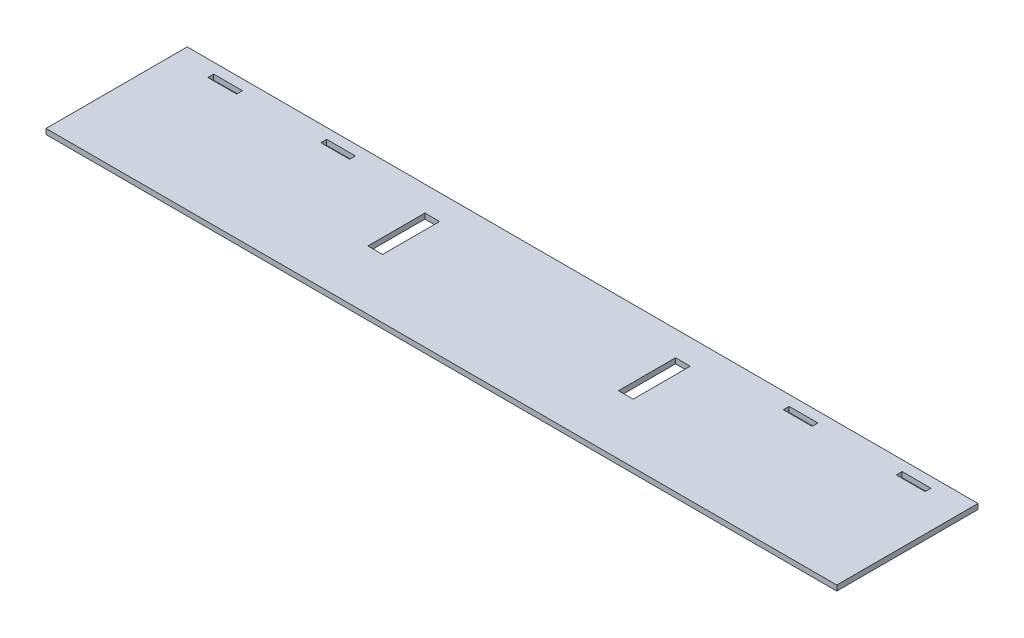
ISO-10303-21;
HEADER;
FILE_DESCRIPTION(('STEP AP214'),'2;1');
FILE_NAME('part.step','',(''),(''),'','','');
FILE_SCHEMA(('AUTOMOTIVE_DESIGN { 1 0 10303 214 1 1 1 1 }'));
ENDSEC;
DATA;
#1=APPLICATION_CONTEXT('core data for automotive mechanical design processes');
#2=APPLICATION_PROTOCOL_DEFINITION('international standard','automotive_design',2000,#1);
#3=PRODUCT_CONTEXT('',#1,'mechanical');
#4=PRODUCT('Part','Part','',(#3));
#5=PRODUCT_RELATED_PRODUCT_CATEGORY('part','',(#4));
#6=PRODUCT_DEFINITION_FORMATION('','',#4);
#7=PRODUCT_DEFINITION_CONTEXT('part definition',#1,'design');
#8=PRODUCT_DEFINITION('design','',#6,#7);
#9=PRODUCT_DEFINITION_SHAPE('','',#8);
#10=(LENGTH_UNIT() NAMED_UNIT(*) SI_UNIT(.MILLI.,.METRE.));
#11=(NAMED_UNIT(*) PLANE_ANGLE_UNIT() SI_UNIT($,.RADIAN.));
#12=(NAMED_UNIT(*) SI_UNIT($,.STERADIAN.) SOLID_ANGLE_UNIT());
#13=UNCERTAINTY_MEASURE_WITH_UNIT(LENGTH_MEASURE(1.E-05),#10,'distance_accuracy_value','');
#14=(GEOMETRIC_REPRESENTATION_CONTEXT(3) GLOBAL_UNCERTAINTY_ASSIGNED_CONTEXT((#13)) GLOBAL_UNIT_ASSIGNED_CONTEXT((#10,
#11,#12)) REPRESENTATION_CONTEXT('',''));
#15=CARTESIAN_POINT('',(0.,0.,0.));
#16=DIRECTION('',(0.,0.,1.));
#17=DIRECTION('',(1.,0.,0.));
#18=AXIS2_PLACEMENT_3D('',#15,#16,#17);
#19=CARTESIAN_POINT('',(-355.6,4.7625,0.));
#20=DIRECTION('',(1.,0.,0.));
#21=DIRECTION('',(0.,0.,-1.));
#22=AXIS2_PLACEMENT_3D('',#19,#20,#21);
#23=PLANE('',#22);
#24=DIRECTION('',(0.,0.,1.));
#25=VECTOR('',#24,1.);
#26=CARTESIAN_POINT('',(-355.6,0.,0.));
#27=LINE('',#26,#25);
#28=CARTESIAN_POINT('',(-355.6,0.,-127.));
#29=VERTEX_POINT('',#28);
#30=CARTESIAN_POINT('',(-355.6,0.,0.));
#31=VERTEX_POINT('',#30);
#32=EDGE_CURVE('E209',#29,#31,#27,.T.);
#33=ORIENTED_EDGE('',*,*,#32,.T.);
#34=DIRECTION('',(0.,-1.,0.));
#35=VECTOR('',#34,1.);
#36=CARTESIAN_POINT('',(-355.6,4.7625,0.));
#37=LINE('',#36,#35);
#38=CARTESIAN_POINT('',(-355.6,4.7625,0.));
#39=VERTEX_POINT('',#38);
#40=EDGE_CURVE('E195',#39,#31,#37,.T.);
#41=ORIENTED_EDGE('',*,*,#40,.F.);
#42=DIRECTION('',(0.,0.,1.));
#43=VECTOR('',#42,1.);
#44=CARTESIAN_POINT('',(-355.6,4.7625,0.));
#45=LINE('',#44,#43);
#46=CARTESIAN_POINT('',(-355.6,4.7625,-127.));
#47=VERTEX_POINT('',#46);
#48=EDGE_CURVE('E228',#47,#39,#45,.T.);
#49=ORIENTED_EDGE('',*,*,#48,.F.);
#50=DIRECTION('',(0.,-1.,0.));
#51=VECTOR('',#50,1.);
#52=CARTESIAN_POINT('',(-355.6,4.7625,-127.));
#53=LINE('',#52,#51);
#54=EDGE_CURVE('E206',#47,#29,#53,.T.);
#55=ORIENTED_EDGE('',*,*,#54,.T.);
#56=EDGE_LOOP('',(#33,#41,#49,#55));
#57=FACE_BOUND('',#56,.T.);
#58=ADVANCED_FACE('F34',(#57),#23,.F.);
#59=CARTESIAN_POINT('',(-355.6,4.7625,0.));
#60=DIRECTION('',(0.,0.,-1.));
#61=DIRECTION('',(-1.,0.,0.));
#62=AXIS2_PLACEMENT_3D('',#59,#60,#61);
#63=PLANE('',#62);
#64=DIRECTION('',(1.,0.,0.));
#65=VECTOR('',#64,1.);
#66=CARTESIAN_POINT('',(-355.6,0.,0.));
#67=LINE('',#66,#65);
#68=CARTESIAN_POINT('',(355.6,0.,0.));
#69=VERTEX_POINT('',#68);
#70=EDGE_CURVE('E199',#31,#69,#67,.T.);
#71=ORIENTED_EDGE('',*,*,#70,.T.);
#72=DIRECTION('',(0.,-1.,0.));
#73=VECTOR('',#72,1.);
#74=CARTESIAN_POINT('',(355.6,4.7625,0.));
#75=LINE('',#74,#73);
#76=CARTESIAN_POINT('',(355.6,4.7625,0.));
#77=VERTEX_POINT('',#76);
#78=EDGE_CURVE('E200',#77,#69,#75,.T.);
#79=ORIENTED_EDGE('',*,*,#78,.F.);
#80=DIRECTION('',(1.,0.,0.));
#81=VECTOR('',#80,1.);
#82=CARTESIAN_POINT('',(-355.6,4.7625,0.));
#83=LINE('',#82,#81);
#84=EDGE_CURVE('E225',#39,#77,#83,.T.);
#85=ORIENTED_EDGE('',*,*,#84,.F.);
#86=ORIENTED_EDGE('',*,*,#40,.T.);
#87=EDGE_LOOP('',(#71,#79,#85,#86));
#88=FACE_BOUND('',#87,.T.);
#89=ADVANCED_FACE('F470',(#88),#63,.F.);
#90=CARTESIAN_POINT('',(355.6,4.7625,0.));
#91=DIRECTION('',(-1.,0.,0.));
#92=DIRECTION('',(0.,0.,1.));
#93=AXIS2_PLACEMENT_3D('',#90,#91,#92);
#94=PLANE('',#93);
#95=DIRECTION('',(0.,0.,-1.));
#96=VECTOR('',#95,1.);
#97=CARTESIAN_POINT('',(355.6,0.,0.));
#98=LINE('',#97,#96);
#99=CARTESIAN_POINT('',(355.6,0.,-127.));
#100=VERTEX_POINT('',#99);
#101=EDGE_CURVE('E198',#69,#100,#98,.T.);
#102=ORIENTED_EDGE('',*,*,#101,.T.);
#103=DIRECTION('',(0.,-1.,0.));
#104=VECTOR('',#103,1.);
#105=CARTESIAN_POINT('',(355.6,4.7625,-127.));
#106=LINE('',#105,#104);
#107=CARTESIAN_POINT('',(355.6,4.7625,-127.));
#108=VERTEX_POINT('',#107);
#109=EDGE_CURVE('E97',#108,#100,#106,.T.);
#110=ORIENTED_EDGE('',*,*,#109,.F.);
#111=DIRECTION('',(0.,0.,-1.));
#112=VECTOR('',#111,1.);
#113=CARTESIAN_POINT('',(355.6,4.7625,0.));
#114=LINE('',#113,#112);
#115=EDGE_CURVE('E222',#77,#108,#114,.T.);
#116=ORIENTED_EDGE('',*,*,#115,.F.);
#117=ORIENTED_EDGE('',*,*,#78,.T.);
#118=EDGE_LOOP('',(#102,#110,#116,#117));
#119=FACE_BOUND('',#118,.T.);
#120=ADVANCED_FACE('F476',(#119),#94,.F.);
#121=CARTESIAN_POINT('',(-355.6,4.7625,-127.));
#122=DIRECTION('',(0.,0.,1.));
#123=DIRECTION('',(1.,0.,0.));
#124=AXIS2_PLACEMENT_3D('',#121,#122,#123);
#125=PLANE('',#124);
#126=DIRECTION('',(-1.,0.,0.));
#127=VECTOR('',#126,1.);
#128=CARTESIAN_POINT('',(-355.6,0.,-127.));
#129=LINE('',#128,#127);
#130=EDGE_CURVE('E203',#100,#29,#129,.T.);
#131=ORIENTED_EDGE('',*,*,#130,.T.);
#132=ORIENTED_EDGE('',*,*,#54,.F.);
#133=DIRECTION('',(-1.,0.,0.));
#134=VECTOR('',#133,1.);
#135=CARTESIAN_POINT('',(-355.6,4.7625,-127.));
#136=LINE('',#135,#134);
#137=EDGE_CURVE('E218',#108,#47,#136,.T.);
#138=ORIENTED_EDGE('',*,*,#137,.F.);
#139=ORIENTED_EDGE('',*,*,#109,.T.);
#140=EDGE_LOOP('',(#131,#132,#138,#139));
#141=FACE_BOUND('',#140,.T.);
#142=ADVANCED_FACE('F531',(#141),#125,.F.);
#143=CARTESIAN_POINT('',(0.,4.7625,0.));
#144=DIRECTION('',(0.,-1.,0.));
#145=DIRECTION('',(0.,0.,-1.));
#146=AXIS2_PLACEMENT_3D('',#143,#144,#145);
#147=PLANE('',#146);
#148=DIRECTION('',(-1.,0.,0.));
#149=VECTOR('',#148,1.);
#150=CARTESIAN_POINT('',(296.6085,4.7625,-112.4585));
#151=LINE('',#150,#149);
#152=CARTESIAN_POINT('',(322.5165,4.7625,-112.4585));
#153=VERTEX_POINT('',#152);
#154=CARTESIAN_POINT('',(296.6085,4.7625,-112.4585));
#155=VERTEX_POINT('',#154);
#156=EDGE_CURVE('E75',#153,#155,#151,.T.);
#157=ORIENTED_EDGE('',*,*,#156,.T.);
#158=DIRECTION('',(0.,0.,-1.));
#159=VECTOR('',#158,1.);
#160=CARTESIAN_POINT('',(296.6085,4.7625,-112.4585));
#161=LINE('',#160,#159);
#162=CARTESIAN_POINT('',(296.6085,4.7625,-117.729));
#163=VERTEX_POINT('',#162);
#164=EDGE_CURVE('E38',#155,#163,#161,.T.);
#165=ORIENTED_EDGE('',*,*,#164,.T.);
#166=DIRECTION('',(1.,0.,0.));
#167=VECTOR('',#166,1.);
#168=CARTESIAN_POINT('',(296.6085,4.7625,-117.729));
#169=LINE('',#168,#167);
#170=CARTESIAN_POINT('',(322.5165,4.7625,-117.729));
#171=VERTEX_POINT('',#170);
#172=EDGE_CURVE('E100',#163,#171,#169,.T.);
#173=ORIENTED_EDGE('',*,*,#172,.T.);
#174=DIRECTION('',(0.,0.,1.));
#175=VECTOR('',#174,1.);
#176=CARTESIAN_POINT('',(322.5165,4.7625,-112.4585));
#177=LINE('',#176,#175);
#178=EDGE_CURVE('E98',#171,#153,#177,.T.);
#179=ORIENTED_EDGE('',*,*,#178,.T.);
#180=EDGE_LOOP('',(#157,#165,#173,#179));
#181=FACE_BOUND('',#180,.T.);
#182=DIRECTION('',(-1.,0.,0.));
#183=VECTOR('',#182,1.);
#184=CARTESIAN_POINT('',(195.0085,4.7625,-112.4585));
#185=LINE('',#184,#183);
#186=CARTESIAN_POINT('',(220.9165,4.7625,-112.4585));
#187=VERTEX_POINT('',#186);
#188=CARTESIAN_POINT('',(195.0085,4.7625,-112.4585));
#189=VERTEX_POINT('',#188);
#190=EDGE_CURVE('E99',#187,#189,#185,.T.);
#191=ORIENTED_EDGE('',*,*,#190,.T.);
#192=DIRECTION('',(0.,0.,-1.));
#193=VECTOR('',#192,1.);
#194=CARTESIAN_POINT('',(195.0085,4.7625,-112.4585));
#195=LINE('',#194,#193);
#196=CARTESIAN_POINT('',(195.0085,4.7625,-117.729));
#197=VERTEX_POINT('',#196);
#198=EDGE_CURVE('E320',#189,#197,#195,.T.);
#199=ORIENTED_EDGE('',*,*,#198,.T.);
#200=DIRECTION('',(1.,0.,0.));
#201=VECTOR('',#200,1.);
#202=CARTESIAN_POINT('',(195.0085,4.7625,-117.729));
#203=LINE('',#202,#201);
#204=CARTESIAN_POINT('',(220.9165,4.7625,-117.729));
#205=VERTEX_POINT('',#204);
#206=EDGE_CURVE('E323',#197,#205,#203,.T.);
#207=ORIENTED_EDGE('',*,*,#206,.T.);
#208=DIRECTION('',(0.,0.,1.));
#209=VECTOR('',#208,1.);
#210=CARTESIAN_POINT('',(220.9165,4.7625,-112.4585));
#211=LINE('',#210,#209);
#212=EDGE_CURVE('E128',#205,#187,#211,.T.);
#213=ORIENTED_EDGE('',*,*,#212,.T.);
#214=EDGE_LOOP('',(#191,#199,#207,#213));
#215=FACE_BOUND('',#214,.T.);
#216=DIRECTION('',(-1.,0.,0.));
#217=VECTOR('',#216,1.);
#218=CARTESIAN_POINT('',(-220.9165,4.7625,-112.4585));
#219=LINE('',#218,#217);
#220=CARTESIAN_POINT('',(-195.0085,4.7625,-112.4585));
#221=VERTEX_POINT('',#220);
#222=CARTESIAN_POINT('',(-220.9165,4.7625,-112.4585));
#223=VERTEX_POINT('',#222);
#224=EDGE_CURVE('E119',#221,#223,#219,.T.);
#225=ORIENTED_EDGE('',*,*,#224,.T.);
#226=DIRECTION('',(0.,0.,-1.));
#227=VECTOR('',#226,1.);
#228=CARTESIAN_POINT('',(-220.9165,4.7625,-117.729));
#229=LINE('',#228,#227);
#230=CARTESIAN_POINT('',(-220.9165,4.7625,-117.729));
#231=VERTEX_POINT('',#230);
#232=EDGE_CURVE('E115',#223,#231,#229,.T.);
#233=ORIENTED_EDGE('',*,*,#232,.T.);
#234=DIRECTION('',(1.,0.,0.));
#235=VECTOR('',#234,1.);
#236=CARTESIAN_POINT('',(-220.9165,4.7625,-117.729));
#237=LINE('',#236,#235);
#238=CARTESIAN_POINT('',(-195.0085,4.7625,-117.729));
#239=VERTEX_POINT('',#238);
#240=EDGE_CURVE('E118',#231,#239,#237,.T.);
#241=ORIENTED_EDGE('',*,*,#240,.T.);
#242=DIRECTION('',(0.,0.,1.));
#243=VECTOR('',#242,1.);
#244=CARTESIAN_POINT('',(-195.0085,4.7625,-117.729));
#245=LINE('',#244,#243);
#246=EDGE_CURVE('E122',#239,#221,#245,.T.);
#247=ORIENTED_EDGE('',*,*,#246,.T.);
#248=EDGE_LOOP('',(#225,#233,#241,#247));
#249=FACE_BOUND('',#248,.T.);
#250=DIRECTION('',(-1.,0.,0.));
#251=VECTOR('',#250,1.);
#252=CARTESIAN_POINT('',(-322.5165,4.7625,-112.4585));
#253=LINE('',#252,#251);
#254=CARTESIAN_POINT('',(-296.6085,4.7625,-112.4585));
#255=VERTEX_POINT('',#254);
#256=CARTESIAN_POINT('',(-322.5165,4.7625,-112.4585));
#257=VERTEX_POINT('',#256);
#258=EDGE_CURVE('E125',#255,#257,#253,.T.);
#259=ORIENTED_EDGE('',*,*,#258,.T.);
#260=DIRECTION('',(0.,0.,-1.));
#261=VECTOR('',#260,1.);
#262=CARTESIAN_POINT('',(-322.5165,4.7625,-117.729));
#263=LINE('',#262,#261);
#264=CARTESIAN_POINT('',(-322.5165,4.7625,-117.729));
#265=VERTEX_POINT('',#264);
#266=EDGE_CURVE('E288',#257,#265,#263,.T.);
#267=ORIENTED_EDGE('',*,*,#266,.T.);
#268=DIRECTION('',(1.,0.,0.));
#269=VECTOR('',#268,1.);
#270=CARTESIAN_POINT('',(-322.5165,4.7625,-117.729));
#271=LINE('',#270,#269);
#272=CARTESIAN_POINT('',(-296.6085,4.7625,-117.729));
#273=VERTEX_POINT('',#272);
#274=EDGE_CURVE('E291',#265,#273,#271,.T.);
#275=ORIENTED_EDGE('',*,*,#274,.T.);
#276=DIRECTION('',(0.,0.,1.));
#277=VECTOR('',#276,1.);
#278=CARTESIAN_POINT('',(-296.6085,4.7625,-117.729));
#279=LINE('',#278,#277);
#280=EDGE_CURVE('E168',#273,#255,#279,.T.);
#281=ORIENTED_EDGE('',*,*,#280,.T.);
#282=EDGE_LOOP('',(#259,#267,#275,#281));
#283=FACE_BOUND('',#282,.T.);
#284=DIRECTION('',(-1.,0.,0.));
#285=VECTOR('',#284,1.);
#286=CARTESIAN_POINT('',(-119.3165,4.7625,-53.1759020301662));
#287=LINE('',#286,#285);
#288=CARTESIAN_POINT('',(-106.1085,4.7625,-53.1759020301662));
#289=VERTEX_POINT('',#288);
#290=CARTESIAN_POINT('',(-119.3165,4.7625,-53.1759020301662));
#291=VERTEX_POINT('',#290);
#292=EDGE_CURVE('E159',#289,#291,#287,.T.);
#293=ORIENTED_EDGE('',*,*,#292,.T.);
#294=DIRECTION('',(0.,0.,-1.));
#295=VECTOR('',#294,1.);
#296=CARTESIAN_POINT('',(-119.3165,4.7625,-104.483902030166));
#297=LINE('',#296,#295);
#298=CARTESIAN_POINT('',(-119.3165,4.7625,-104.483902030166));
#299=VERTEX_POINT('',#298);
#300=EDGE_CURVE('E155',#291,#299,#297,.T.);
#301=ORIENTED_EDGE('',*,*,#300,.T.);
#302=DIRECTION('',(1.,0.,0.));
#303=VECTOR('',#302,1.);
#304=CARTESIAN_POINT('',(-119.3165,4.7625,-104.483902030166));
#305=LINE('',#304,#303);
#306=CARTESIAN_POINT('',(-106.1085,4.7625,-104.483902030166));
#307=VERTEX_POINT('',#306);
#308=EDGE_CURVE('E158',#299,#307,#305,.T.);
#309=ORIENTED_EDGE('',*,*,#308,.T.);
#310=DIRECTION('',(0.,0.,1.));
#311=VECTOR('',#310,1.);
#312=CARTESIAN_POINT('',(-106.1085,4.7625,-104.483902030166));
#313=LINE('',#312,#311);
#314=EDGE_CURVE('E162',#307,#289,#313,.T.);
#315=ORIENTED_EDGE('',*,*,#314,.T.);
#316=EDGE_LOOP('',(#293,#301,#309,#315));
#317=FACE_BOUND('',#316,.T.);
#318=DIRECTION('',(0.,0.,-1.));
#319=VECTOR('',#318,1.);
#320=CARTESIAN_POINT('',(106.1085,4.7625,-104.483902030166));
#321=LINE('',#320,#319);
#322=CARTESIAN_POINT('',(106.1085,4.7625,-53.1759020301661));
#323=VERTEX_POINT('',#322);
#324=CARTESIAN_POINT('',(106.1085,4.7625,-104.483902030166));
#325=VERTEX_POINT('',#324);
#326=EDGE_CURVE('E165',#323,#325,#321,.T.);
#327=ORIENTED_EDGE('',*,*,#326,.T.);
#328=DIRECTION('',(1.,0.,0.));
#329=VECTOR('',#328,1.);
#330=CARTESIAN_POINT('',(106.1085,4.7625,-104.483902030166));
#331=LINE('',#330,#329);
#332=CARTESIAN_POINT('',(119.3165,4.7625,-104.483902030166));
#333=VERTEX_POINT('',#332);
#334=EDGE_CURVE('E256',#325,#333,#331,.T.);
#335=ORIENTED_EDGE('',*,*,#334,.T.);
#336=DIRECTION('',(0.,0.,1.));
#337=VECTOR('',#336,1.);
#338=CARTESIAN_POINT('',(119.3165,4.7625,-104.483902030166));
#339=LINE('',#338,#337);
#340=CARTESIAN_POINT('',(119.3165,4.7625,-53.1759020301661));
#341=VERTEX_POINT('',#340);
#342=EDGE_CURVE('E259',#333,#341,#339,.T.);
#343=ORIENTED_EDGE('',*,*,#342,.T.);
#344=DIRECTION('',(-1.,0.,0.));
#345=VECTOR('',#344,1.);
#346=CARTESIAN_POINT('',(106.1085,4.7625,-53.1759020301661));
#347=LINE('',#346,#345);
#348=EDGE_CURVE('E231',#341,#323,#347,.T.);
#349=ORIENTED_EDGE('',*,*,#348,.T.);
#350=EDGE_LOOP('',(#327,#335,#343,#349));
#351=FACE_BOUND('',#350,.T.);
#352=ORIENTED_EDGE('',*,*,#48,.T.);
#353=ORIENTED_EDGE('',*,*,#84,.T.);
#354=ORIENTED_EDGE('',*,*,#115,.T.);
#355=ORIENTED_EDGE('',*,*,#137,.T.);
#356=EDGE_LOOP('',(#352,#353,#354,#355));
#357=FACE_BOUND('',#356,.T.);
#358=ADVANCED_FACE('F36',(#181,#215,#249,#283,#317,#351,#357),#147,.F.);
#359=CARTESIAN_POINT('',(0.,0.,0.));
#360=DIRECTION('',(0.,-1.,0.));
#361=DIRECTION('',(0.,0.,-1.));
#362=AXIS2_PLACEMENT_3D('',#359,#360,#361);
#363=PLANE('',#362);
#364=DIRECTION('',(0.,0.,-1.));
#365=VECTOR('',#364,1.);
#366=CARTESIAN_POINT('',(296.6085,0.,-112.4585));
#367=LINE('',#366,#365);
#368=CARTESIAN_POINT('',(296.6085,0.,-112.4585));
#369=VERTEX_POINT('',#368);
#370=CARTESIAN_POINT('',(296.6085,0.,-117.729));
#371=VERTEX_POINT('',#370);
#372=EDGE_CURVE('E87',#369,#371,#367,.T.);
#373=ORIENTED_EDGE('',*,*,#372,.F.);
#374=DIRECTION('',(-1.,0.,0.));
#375=VECTOR('',#374,1.);
#376=CARTESIAN_POINT('',(296.6085,0.,-112.4585));
#377=LINE('',#376,#375);
#378=CARTESIAN_POINT('',(322.5165,0.,-112.4585));
#379=VERTEX_POINT('',#378);
#380=EDGE_CURVE('E72',#379,#369,#377,.T.);
#381=ORIENTED_EDGE('',*,*,#380,.F.);
#382=DIRECTION('',(0.,0.,1.));
#383=VECTOR('',#382,1.);
#384=CARTESIAN_POINT('',(322.5165,0.,-112.4585));
#385=LINE('',#384,#383);
#386=CARTESIAN_POINT('',(322.5165,0.,-117.729));
#387=VERTEX_POINT('',#386);
#388=EDGE_CURVE('E77',#387,#379,#385,.T.);
#389=ORIENTED_EDGE('',*,*,#388,.F.);
#390=DIRECTION('',(1.,0.,0.));
#391=VECTOR('',#390,1.);
#392=CARTESIAN_POINT('',(296.6085,0.,-117.729));
#393=LINE('',#392,#391);
#394=EDGE_CURVE('E44',#371,#387,#393,.T.);
#395=ORIENTED_EDGE('',*,*,#394,.F.);
#396=EDGE_LOOP('',(#373,#381,#389,#395));
#397=FACE_BOUND('',#396,.T.);
#398=DIRECTION('',(0.,0.,-1.));
#399=VECTOR('',#398,1.);
#400=CARTESIAN_POINT('',(195.0085,0.,-112.4585));
#401=LINE('',#400,#399);
#402=CARTESIAN_POINT('',(195.0085,0.,-112.4585));
#403=VERTEX_POINT('',#402);
#404=CARTESIAN_POINT('',(195.0085,0.,-117.729));
#405=VERTEX_POINT('',#404);
#406=EDGE_CURVE('E154',#403,#405,#401,.T.);
#407=ORIENTED_EDGE('',*,*,#406,.F.);
#408=DIRECTION('',(-1.,0.,0.));
#409=VECTOR('',#408,1.);
#410=CARTESIAN_POINT('',(195.0085,0.,-112.4585));
#411=LINE('',#410,#409);
#412=CARTESIAN_POINT('',(220.9165,0.,-112.4585));
#413=VERTEX_POINT('',#412);
#414=EDGE_CURVE('E306',#413,#403,#411,.T.);
#415=ORIENTED_EDGE('',*,*,#414,.F.);
#416=DIRECTION('',(0.,0.,1.));
#417=VECTOR('',#416,1.);
#418=CARTESIAN_POINT('',(220.9165,0.,-112.4585));
#419=LINE('',#418,#417);
#420=CARTESIAN_POINT('',(220.9165,0.,-117.729));
#421=VERTEX_POINT('',#420);
#422=EDGE_CURVE('E302',#421,#413,#419,.T.);
#423=ORIENTED_EDGE('',*,*,#422,.F.);
#424=DIRECTION('',(1.,0.,0.));
#425=VECTOR('',#424,1.);
#426=CARTESIAN_POINT('',(195.0085,0.,-117.729));
#427=LINE('',#426,#425);
#428=EDGE_CURVE('E298',#405,#421,#427,.T.);
#429=ORIENTED_EDGE('',*,*,#428,.F.);
#430=EDGE_LOOP('',(#407,#415,#423,#429));
#431=FACE_BOUND('',#430,.T.);
#432=DIRECTION('',(0.,0.,-1.));
#433=VECTOR('',#432,1.);
#434=CARTESIAN_POINT('',(-220.9165,0.,-117.729));
#435=LINE('',#434,#433);
#436=CARTESIAN_POINT('',(-220.9165,0.,-112.4585));
#437=VERTEX_POINT('',#436);
#438=CARTESIAN_POINT('',(-220.9165,0.,-117.729));
#439=VERTEX_POINT('',#438);
#440=EDGE_CURVE('E129',#437,#439,#435,.T.);
#441=ORIENTED_EDGE('',*,*,#440,.F.);
#442=DIRECTION('',(-1.,0.,0.));
#443=VECTOR('',#442,1.);
#444=CARTESIAN_POINT('',(-220.9165,0.,-112.4585));
#445=LINE('',#444,#443);
#446=CARTESIAN_POINT('',(-195.0085,0.,-112.4585));
#447=VERTEX_POINT('',#446);
#448=EDGE_CURVE('E143',#447,#437,#445,.T.);
#449=ORIENTED_EDGE('',*,*,#448,.F.);
#450=DIRECTION('',(0.,0.,1.));
#451=VECTOR('',#450,1.);
#452=CARTESIAN_POINT('',(-195.0085,0.,-117.729));
#453=LINE('',#452,#451);
#454=CARTESIAN_POINT('',(-195.0085,0.,-117.729));
#455=VERTEX_POINT('',#454);
#456=EDGE_CURVE('E139',#455,#447,#453,.T.);
#457=ORIENTED_EDGE('',*,*,#456,.F.);
#458=DIRECTION('',(1.,0.,0.));
#459=VECTOR('',#458,1.);
#460=CARTESIAN_POINT('',(-220.9165,0.,-117.729));
#461=LINE('',#460,#459);
#462=EDGE_CURVE('E134',#439,#455,#461,.T.);
#463=ORIENTED_EDGE('',*,*,#462,.F.);
#464=EDGE_LOOP('',(#441,#449,#457,#463));
#465=FACE_BOUND('',#464,.T.);
#466=DIRECTION('',(0.,0.,-1.));
#467=VECTOR('',#466,1.);
#468=CARTESIAN_POINT('',(-322.5165,0.,-117.729));
#469=LINE('',#468,#467);
#470=CARTESIAN_POINT('',(-322.5165,0.,-112.4585));
#471=VERTEX_POINT('',#470);
#472=CARTESIAN_POINT('',(-322.5165,0.,-117.729));
#473=VERTEX_POINT('',#472);
#474=EDGE_CURVE('E194',#471,#473,#469,.T.);
#475=ORIENTED_EDGE('',*,*,#474,.F.);
#476=DIRECTION('',(-1.,0.,0.));
#477=VECTOR('',#476,1.);
#478=CARTESIAN_POINT('',(-322.5165,0.,-112.4585));
#479=LINE('',#478,#477);
#480=CARTESIAN_POINT('',(-296.6085,0.,-112.4585));
#481=VERTEX_POINT('',#480);
#482=EDGE_CURVE('E274',#481,#471,#479,.T.);
#483=ORIENTED_EDGE('',*,*,#482,.F.);
#484=DIRECTION('',(0.,0.,1.));
#485=VECTOR('',#484,1.);
#486=CARTESIAN_POINT('',(-296.6085,0.,-117.729));
#487=LINE('',#486,#485);
#488=CARTESIAN_POINT('',(-296.6085,0.,-117.729));
#489=VERTEX_POINT('',#488);
#490=EDGE_CURVE('E270',#489,#481,#487,.T.);
#491=ORIENTED_EDGE('',*,*,#490,.F.);
#492=DIRECTION('',(1.,0.,0.));
#493=VECTOR('',#492,1.);
#494=CARTESIAN_POINT('',(-322.5165,0.,-117.729));
#495=LINE('',#494,#493);
#496=EDGE_CURVE('E266',#473,#489,#495,.T.);
#497=ORIENTED_EDGE('',*,*,#496,.F.);
#498=EDGE_LOOP('',(#475,#483,#491,#497));
#499=FACE_BOUND('',#498,.T.);
#500=DIRECTION('',(0.,0.,-1.));
#501=VECTOR('',#500,1.);
#502=CARTESIAN_POINT('',(-119.3165,0.,-104.483902030166));
#503=LINE('',#502,#501);
#504=CARTESIAN_POINT('',(-119.3165,0.,-53.1759020301662));
#505=VERTEX_POINT('',#504);
#506=CARTESIAN_POINT('',(-119.3165,0.,-104.483902030166));
#507=VERTEX_POINT('',#506);
#508=EDGE_CURVE('E169',#505,#507,#503,.T.);
#509=ORIENTED_EDGE('',*,*,#508,.F.);
#510=DIRECTION('',(-1.,0.,0.));
#511=VECTOR('',#510,1.);
#512=CARTESIAN_POINT('',(-119.3165,0.,-53.1759020301662));
#513=LINE('',#512,#511);
#514=CARTESIAN_POINT('',(-106.1085,0.,-53.1759020301662));
#515=VERTEX_POINT('',#514);
#516=EDGE_CURVE('E183',#515,#505,#513,.T.);
#517=ORIENTED_EDGE('',*,*,#516,.F.);
#518=DIRECTION('',(0.,0.,1.));
#519=VECTOR('',#518,1.);
#520=CARTESIAN_POINT('',(-106.1085,0.,-104.483902030166));
#521=LINE('',#520,#519);
#522=CARTESIAN_POINT('',(-106.1085,0.,-104.483902030166));
#523=VERTEX_POINT('',#522);
#524=EDGE_CURVE('E179',#523,#515,#521,.T.);
#525=ORIENTED_EDGE('',*,*,#524,.F.);
#526=DIRECTION('',(1.,0.,0.));
#527=VECTOR('',#526,1.);
#528=CARTESIAN_POINT('',(-119.3165,0.,-104.483902030166));
#529=LINE('',#528,#527);
#530=EDGE_CURVE('E174',#507,#523,#529,.T.);
#531=ORIENTED_EDGE('',*,*,#530,.F.);
#532=EDGE_LOOP('',(#509,#517,#525,#531));
#533=FACE_BOUND('',#532,.T.);
#534=DIRECTION('',(1.,0.,0.));
#535=VECTOR('',#534,1.);
#536=CARTESIAN_POINT('',(106.1085,0.,-104.483902030166));
#537=LINE('',#536,#535);
#538=CARTESIAN_POINT('',(106.1085,0.,-104.483902030166));
#539=VERTEX_POINT('',#538);
#540=CARTESIAN_POINT('',(119.3165,0.,-104.483902030166));
#541=VERTEX_POINT('',#540);
#542=EDGE_CURVE('E221',#539,#541,#537,.T.);
#543=ORIENTED_EDGE('',*,*,#542,.F.);
#544=DIRECTION('',(0.,0.,-1.));
#545=VECTOR('',#544,1.);
#546=CARTESIAN_POINT('',(106.1085,0.,-104.483902030166));
#547=LINE('',#546,#545);
#548=CARTESIAN_POINT('',(106.1085,0.,-53.1759020301661));
#549=VERTEX_POINT('',#548);
#550=EDGE_CURVE('E242',#549,#539,#547,.T.);
#551=ORIENTED_EDGE('',*,*,#550,.F.);
#552=DIRECTION('',(-1.,0.,0.));
#553=VECTOR('',#552,1.);
#554=CARTESIAN_POINT('',(106.1085,0.,-53.1759020301661));
#555=LINE('',#554,#553);
#556=CARTESIAN_POINT('',(119.3165,0.,-53.1759020301661));
#557=VERTEX_POINT('',#556);
#558=EDGE_CURVE('E238',#557,#549,#555,.T.);
#559=ORIENTED_EDGE('',*,*,#558,.F.);
#560=DIRECTION('',(0.,0.,1.));
#561=VECTOR('',#560,1.);
#562=CARTESIAN_POINT('',(119.3165,0.,-104.483902030166));
#563=LINE('',#562,#561);
#564=EDGE_CURVE('E234',#541,#557,#563,.T.);
#565=ORIENTED_EDGE('',*,*,#564,.F.);
#566=EDGE_LOOP('',(#543,#551,#559,#565));
#567=FACE_BOUND('',#566,.T.);
#568=ORIENTED_EDGE('',*,*,#32,.F.);
#569=ORIENTED_EDGE('',*,*,#130,.F.);
#570=ORIENTED_EDGE('',*,*,#101,.F.);
#571=ORIENTED_EDGE('',*,*,#70,.F.);
#572=EDGE_LOOP('',(#568,#569,#570,#571));
#573=FACE_BOUND('',#572,.T.);
#574=ADVANCED_FACE('F84',(#397,#431,#465,#499,#533,#567,#573),#363,.T.);
#575=CARTESIAN_POINT('',(106.1085,4.7625,-104.483902030166));
#576=DIRECTION('',(0.,0.,-1.));
#577=DIRECTION('',(-1.,0.,0.));
#578=AXIS2_PLACEMENT_3D('',#575,#576,#577);
#579=PLANE('',#578);
#580=ORIENTED_EDGE('',*,*,#542,.T.);
#581=DIRECTION('',(0.,-1.,0.));
#582=VECTOR('',#581,1.);
#583=CARTESIAN_POINT('',(119.3165,4.7625,-104.483902030166));
#584=LINE('',#583,#582);
#585=EDGE_CURVE('E173',#333,#541,#584,.T.);
#586=ORIENTED_EDGE('',*,*,#585,.F.);
#587=ORIENTED_EDGE('',*,*,#334,.F.);
#588=DIRECTION('',(0.,-1.,0.));
#589=VECTOR('',#588,1.);
#590=CARTESIAN_POINT('',(106.1085,4.7625,-104.483902030166));
#591=LINE('',#590,#589);
#592=EDGE_CURVE('E243',#325,#539,#591,.T.);
#593=ORIENTED_EDGE('',*,*,#592,.T.);
#594=EDGE_LOOP('',(#580,#586,#587,#593));
#595=FACE_BOUND('',#594,.T.);
#596=ADVANCED_FACE('F523',(#595),#579,.F.);
#597=CARTESIAN_POINT('',(106.1085,4.7625,-104.483902030166));
#598=DIRECTION('',(-1.,0.,0.));
#599=DIRECTION('',(0.,0.,1.));
#600=AXIS2_PLACEMENT_3D('',#597,#598,#599);
#601=PLANE('',#600);
#602=ORIENTED_EDGE('',*,*,#550,.T.);
#603=ORIENTED_EDGE('',*,*,#592,.F.);
#604=ORIENTED_EDGE('',*,*,#326,.F.);
#605=DIRECTION('',(0.,-1.,0.));
#606=VECTOR('',#605,1.);
#607=CARTESIAN_POINT('',(106.1085,4.7625,-53.1759020301661));
#608=LINE('',#607,#606);
#609=EDGE_CURVE('E239',#323,#549,#608,.T.);
#610=ORIENTED_EDGE('',*,*,#609,.T.);
#611=EDGE_LOOP('',(#602,#603,#604,#610));
#612=FACE_BOUND('',#611,.T.);
#613=ADVANCED_FACE('F528',(#612),#601,.F.);
#614=CARTESIAN_POINT('',(106.1085,4.7625,-53.1759020301661));
#615=DIRECTION('',(0.,0.,1.));
#616=DIRECTION('',(1.,0.,0.));
#617=AXIS2_PLACEMENT_3D('',#614,#615,#616);
#618=PLANE('',#617);
#619=ORIENTED_EDGE('',*,*,#558,.T.);
#620=ORIENTED_EDGE('',*,*,#609,.F.);
#621=ORIENTED_EDGE('',*,*,#348,.F.);
#622=DIRECTION('',(0.,-1.,0.));
#623=VECTOR('',#622,1.);
#624=CARTESIAN_POINT('',(119.3165,4.7625,-53.1759020301661));
#625=LINE('',#624,#623);
#626=EDGE_CURVE('E235',#341,#557,#625,.T.);
#627=ORIENTED_EDGE('',*,*,#626,.T.);
#628=EDGE_LOOP('',(#619,#620,#621,#627));
#629=FACE_BOUND('',#628,.T.);
#630=ADVANCED_FACE('F544',(#629),#618,.F.);
#631=CARTESIAN_POINT('',(119.3165,4.7625,-104.483902030166));
#632=DIRECTION('',(1.,0.,0.));
#633=DIRECTION('',(0.,0.,-1.));
#634=AXIS2_PLACEMENT_3D('',#631,#632,#633);
#635=PLANE('',#634);
#636=ORIENTED_EDGE('',*,*,#564,.T.);
#637=ORIENTED_EDGE('',*,*,#626,.F.);
#638=ORIENTED_EDGE('',*,*,#342,.F.);
#639=ORIENTED_EDGE('',*,*,#585,.T.);
#640=EDGE_LOOP('',(#636,#637,#638,#639));
#641=FACE_BOUND('',#640,.T.);
#642=ADVANCED_FACE('F485',(#641),#635,.F.);
#643=CARTESIAN_POINT('',(-119.3165,4.7625,-104.483902030166));
#644=DIRECTION('',(-1.,0.,0.));
#645=DIRECTION('',(0.,0.,1.));
#646=AXIS2_PLACEMENT_3D('',#643,#644,#645);
#647=PLANE('',#646);
#648=ORIENTED_EDGE('',*,*,#508,.T.);
#649=DIRECTION('',(0.,-1.,0.));
#650=VECTOR('',#649,1.);
#651=CARTESIAN_POINT('',(-119.3165,4.7625,-104.483902030166));
#652=LINE('',#651,#650);
#653=EDGE_CURVE('E177',#299,#507,#652,.T.);
#654=ORIENTED_EDGE('',*,*,#653,.F.);
#655=ORIENTED_EDGE('',*,*,#300,.F.);
#656=DIRECTION('',(0.,-1.,0.));
#657=VECTOR('',#656,1.);
#658=CARTESIAN_POINT('',(-119.3165,4.7625,-53.1759020301662));
#659=LINE('',#658,#657);
#660=EDGE_CURVE('E172',#291,#505,#659,.T.);
#661=ORIENTED_EDGE('',*,*,#660,.T.);
#662=EDGE_LOOP('',(#648,#654,#655,#661));
#663=FACE_BOUND('',#662,.T.);
#664=ADVANCED_FACE('F481',(#663),#647,.F.);
#665=CARTESIAN_POINT('',(-119.3165,4.7625,-53.1759020301662));
#666=DIRECTION('',(0.,0.,1.));
#667=DIRECTION('',(1.,0.,0.));
#668=AXIS2_PLACEMENT_3D('',#665,#666,#667);
#669=PLANE('',#668);
#670=ORIENTED_EDGE('',*,*,#516,.T.);
#671=ORIENTED_EDGE('',*,*,#660,.F.);
#672=ORIENTED_EDGE('',*,*,#292,.F.);
#673=DIRECTION('',(0.,-1.,0.));
#674=VECTOR('',#673,1.);
#675=CARTESIAN_POINT('',(-106.1085,4.7625,-53.1759020301662));
#676=LINE('',#675,#674);
#677=EDGE_CURVE('E182',#289,#515,#676,.T.);
#678=ORIENTED_EDGE('',*,*,#677,.T.);
#679=EDGE_LOOP('',(#670,#671,#672,#678));
#680=FACE_BOUND('',#679,.T.);
#681=ADVANCED_FACE('F484',(#680),#669,.F.);
#682=CARTESIAN_POINT('',(-106.1085,4.7625,-104.483902030166));
#683=DIRECTION('',(1.,0.,0.));
#684=DIRECTION('',(0.,0.,-1.));
#685=AXIS2_PLACEMENT_3D('',#682,#683,#684);
#686=PLANE('',#685);
#687=ORIENTED_EDGE('',*,*,#524,.T.);
#688=ORIENTED_EDGE('',*,*,#677,.F.);
#689=ORIENTED_EDGE('',*,*,#314,.F.);
#690=DIRECTION('',(0.,-1.,0.));
#691=VECTOR('',#690,1.);
#692=CARTESIAN_POINT('',(-106.1085,4.7625,-104.483902030166));
#693=LINE('',#692,#691);
#694=EDGE_CURVE('E178',#307,#523,#693,.T.);
#695=ORIENTED_EDGE('',*,*,#694,.T.);
#696=EDGE_LOOP('',(#687,#688,#689,#695));
#697=FACE_BOUND('',#696,.T.);
#698=ADVANCED_FACE('F491',(#697),#686,.F.);
#699=CARTESIAN_POINT('',(-119.3165,4.7625,-104.483902030166));
#700=DIRECTION('',(0.,0.,-1.));
#701=DIRECTION('',(-1.,0.,0.));
#702=AXIS2_PLACEMENT_3D('',#699,#700,#701);
#703=PLANE('',#702);
#704=ORIENTED_EDGE('',*,*,#530,.T.);
#705=ORIENTED_EDGE('',*,*,#694,.F.);
#706=ORIENTED_EDGE('',*,*,#308,.F.);
#707=ORIENTED_EDGE('',*,*,#653,.T.);
#708=EDGE_LOOP('',(#704,#705,#706,#707));
#709=FACE_BOUND('',#708,.T.);
#710=ADVANCED_FACE('F487',(#709),#703,.F.);
#711=CARTESIAN_POINT('',(-322.5165,4.7625,-117.729));
#712=DIRECTION('',(-1.,0.,0.));
#713=DIRECTION('',(0.,0.,1.));
#714=AXIS2_PLACEMENT_3D('',#711,#712,#713);
#715=PLANE('',#714);
#716=ORIENTED_EDGE('',*,*,#474,.T.);
#717=DIRECTION('',(0.,-1.,0.));
#718=VECTOR('',#717,1.);
#719=CARTESIAN_POINT('',(-322.5165,4.7625,-117.729));
#720=LINE('',#719,#718);
#721=EDGE_CURVE('E133',#265,#473,#720,.T.);
#722=ORIENTED_EDGE('',*,*,#721,.F.);
#723=ORIENTED_EDGE('',*,*,#266,.F.);
#724=DIRECTION('',(0.,-1.,0.));
#725=VECTOR('',#724,1.);
#726=CARTESIAN_POINT('',(-322.5165,4.7625,-112.4585));
#727=LINE('',#726,#725);
#728=EDGE_CURVE('E275',#257,#471,#727,.T.);
#729=ORIENTED_EDGE('',*,*,#728,.T.);
#730=EDGE_LOOP('',(#716,#722,#723,#729));
#731=FACE_BOUND('',#730,.T.);
#732=ADVANCED_FACE('F490',(#731),#715,.F.);
#733=CARTESIAN_POINT('',(-322.5165,4.7625,-112.4585));
#734=DIRECTION('',(0.,0.,1.));
#735=DIRECTION('',(1.,0.,0.));
#736=AXIS2_PLACEMENT_3D('',#733,#734,#735);
#737=PLANE('',#736);
#738=ORIENTED_EDGE('',*,*,#482,.T.);
#739=ORIENTED_EDGE('',*,*,#728,.F.);
#740=ORIENTED_EDGE('',*,*,#258,.F.);
#741=DIRECTION('',(0.,-1.,0.));
#742=VECTOR('',#741,1.);
#743=CARTESIAN_POINT('',(-296.6085,4.7625,-112.4585));
#744=LINE('',#743,#742);
#745=EDGE_CURVE('E271',#255,#481,#744,.T.);
#746=ORIENTED_EDGE('',*,*,#745,.T.);
#747=EDGE_LOOP('',(#738,#739,#740,#746));
#748=FACE_BOUND('',#747,.T.);
#749=ADVANCED_FACE('F554',(#748),#737,.F.);
#750=CARTESIAN_POINT('',(-296.6085,4.7625,-117.729));
#751=DIRECTION('',(1.,0.,0.));
#752=DIRECTION('',(0.,0.,-1.));
#753=AXIS2_PLACEMENT_3D('',#750,#751,#752);
#754=PLANE('',#753);
#755=ORIENTED_EDGE('',*,*,#490,.T.);
#756=ORIENTED_EDGE('',*,*,#745,.F.);
#757=ORIENTED_EDGE('',*,*,#280,.F.);
#758=DIRECTION('',(0.,-1.,0.));
#759=VECTOR('',#758,1.);
#760=CARTESIAN_POINT('',(-296.6085,4.7625,-117.729));
#761=LINE('',#760,#759);
#762=EDGE_CURVE('E267',#273,#489,#761,.T.);
#763=ORIENTED_EDGE('',*,*,#762,.T.);
#764=EDGE_LOOP('',(#755,#756,#757,#763));
#765=FACE_BOUND('',#764,.T.);
#766=ADVANCED_FACE('F558',(#765),#754,.F.);
#767=CARTESIAN_POINT('',(-322.5165,4.7625,-117.729));
#768=DIRECTION('',(0.,0.,-1.));
#769=DIRECTION('',(-1.,0.,0.));
#770=AXIS2_PLACEMENT_3D('',#767,#768,#769);
#771=PLANE('',#770);
#772=ORIENTED_EDGE('',*,*,#496,.T.);
#773=ORIENTED_EDGE('',*,*,#762,.F.);
#774=ORIENTED_EDGE('',*,*,#274,.F.);
#775=ORIENTED_EDGE('',*,*,#721,.T.);
#776=EDGE_LOOP('',(#772,#773,#774,#775));
#777=FACE_BOUND('',#776,.T.);
#778=ADVANCED_FACE('F503',(#777),#771,.F.);
#779=CARTESIAN_POINT('',(-220.9165,4.7625,-117.729));
#780=DIRECTION('',(-1.,0.,0.));
#781=DIRECTION('',(0.,0.,1.));
#782=AXIS2_PLACEMENT_3D('',#779,#780,#781);
#783=PLANE('',#782);
#784=ORIENTED_EDGE('',*,*,#440,.T.);
#785=DIRECTION('',(0.,-1.,0.));
#786=VECTOR('',#785,1.);
#787=CARTESIAN_POINT('',(-220.9165,4.7625,-117.729));
#788=LINE('',#787,#786);
#789=EDGE_CURVE('E137',#231,#439,#788,.T.);
#790=ORIENTED_EDGE('',*,*,#789,.F.);
#791=ORIENTED_EDGE('',*,*,#232,.F.);
#792=DIRECTION('',(0.,-1.,0.));
#793=VECTOR('',#792,1.);
#794=CARTESIAN_POINT('',(-220.9165,4.7625,-112.4585));
#795=LINE('',#794,#793);
#796=EDGE_CURVE('E132',#223,#437,#795,.T.);
#797=ORIENTED_EDGE('',*,*,#796,.T.);
#798=EDGE_LOOP('',(#784,#790,#791,#797));
#799=FACE_BOUND('',#798,.T.);
#800=ADVANCED_FACE('F499',(#799),#783,.F.);
#801=CARTESIAN_POINT('',(-220.9165,4.7625,-112.4585));
#802=DIRECTION('',(0.,0.,1.));
#803=DIRECTION('',(1.,0.,0.));
#804=AXIS2_PLACEMENT_3D('',#801,#802,#803);
#805=PLANE('',#804);
#806=ORIENTED_EDGE('',*,*,#448,.T.);
#807=ORIENTED_EDGE('',*,*,#796,.F.);
#808=ORIENTED_EDGE('',*,*,#224,.F.);
#809=DIRECTION('',(0.,-1.,0.));
#810=VECTOR('',#809,1.);
#811=CARTESIAN_POINT('',(-195.0085,4.7625,-112.4585));
#812=LINE('',#811,#810);
#813=EDGE_CURVE('E142',#221,#447,#812,.T.);
#814=ORIENTED_EDGE('',*,*,#813,.T.);
#815=EDGE_LOOP('',(#806,#807,#808,#814));
#816=FACE_BOUND('',#815,.T.);
#817=ADVANCED_FACE('F502',(#816),#805,.F.);
#818=CARTESIAN_POINT('',(-195.0085,4.7625,-117.729));
#819=DIRECTION('',(1.,0.,0.));
#820=DIRECTION('',(0.,0.,-1.));
#821=AXIS2_PLACEMENT_3D('',#818,#819,#820);
#822=PLANE('',#821);
#823=ORIENTED_EDGE('',*,*,#456,.T.);
#824=ORIENTED_EDGE('',*,*,#813,.F.);
#825=ORIENTED_EDGE('',*,*,#246,.F.);
#826=DIRECTION('',(0.,-1.,0.));
#827=VECTOR('',#826,1.);
#828=CARTESIAN_POINT('',(-195.0085,4.7625,-117.729));
#829=LINE('',#828,#827);
#830=EDGE_CURVE('E138',#239,#455,#829,.T.);
#831=ORIENTED_EDGE('',*,*,#830,.T.);
#832=EDGE_LOOP('',(#823,#824,#825,#831));
#833=FACE_BOUND('',#832,.T.);
#834=ADVANCED_FACE('F507',(#833),#822,.F.);
#835=CARTESIAN_POINT('',(-220.9165,4.7625,-117.729));
#836=DIRECTION('',(0.,0.,-1.));
#837=DIRECTION('',(-1.,0.,0.));
#838=AXIS2_PLACEMENT_3D('',#835,#836,#837);
#839=PLANE('',#838);
#840=ORIENTED_EDGE('',*,*,#462,.T.);
#841=ORIENTED_EDGE('',*,*,#830,.F.);
#842=ORIENTED_EDGE('',*,*,#240,.F.);
#843=ORIENTED_EDGE('',*,*,#789,.T.);
#844=EDGE_LOOP('',(#840,#841,#842,#843));
#845=FACE_BOUND('',#844,.T.);
#846=ADVANCED_FACE('F467',(#845),#839,.F.);
#847=CARTESIAN_POINT('',(195.0085,4.7625,-112.4585));
#848=DIRECTION('',(-1.,0.,0.));
#849=DIRECTION('',(0.,0.,1.));
#850=AXIS2_PLACEMENT_3D('',#847,#848,#849);
#851=PLANE('',#850);
#852=ORIENTED_EDGE('',*,*,#406,.T.);
#853=DIRECTION('',(0.,-1.,0.));
#854=VECTOR('',#853,1.);
#855=CARTESIAN_POINT('',(195.0085,4.7625,-117.729));
#856=LINE('',#855,#854);
#857=EDGE_CURVE('E95',#197,#405,#856,.T.);
#858=ORIENTED_EDGE('',*,*,#857,.F.);
#859=ORIENTED_EDGE('',*,*,#198,.F.);
#860=DIRECTION('',(0.,-1.,0.));
#861=VECTOR('',#860,1.);
#862=CARTESIAN_POINT('',(195.0085,4.7625,-112.4585));
#863=LINE('',#862,#861);
#864=EDGE_CURVE('E307',#189,#403,#863,.T.);
#865=ORIENTED_EDGE('',*,*,#864,.T.);
#866=EDGE_LOOP('',(#852,#858,#859,#865));
#867=FACE_BOUND('',#866,.T.);
#868=ADVANCED_FACE('F339',(#867),#851,.F.);
#869=CARTESIAN_POINT('',(195.0085,4.7625,-112.4585));
#870=DIRECTION('',(0.,0.,1.));
#871=DIRECTION('',(1.,0.,0.));
#872=AXIS2_PLACEMENT_3D('',#869,#870,#871);
#873=PLANE('',#872);
#874=ORIENTED_EDGE('',*,*,#414,.T.);
#875=ORIENTED_EDGE('',*,*,#864,.F.);
#876=ORIENTED_EDGE('',*,*,#190,.F.);
#877=DIRECTION('',(0.,-1.,0.));
#878=VECTOR('',#877,1.);
#879=CARTESIAN_POINT('',(220.9165,4.7625,-112.4585));
#880=LINE('',#879,#878);
#881=EDGE_CURVE('E303',#187,#413,#880,.T.);
#882=ORIENTED_EDGE('',*,*,#881,.T.);
#883=EDGE_LOOP('',(#874,#875,#876,#882));
#884=FACE_BOUND('',#883,.T.);
#885=ADVANCED_FACE('F457',(#884),#873,.F.);
#886=CARTESIAN_POINT('',(220.9165,4.7625,-112.4585));
#887=DIRECTION('',(1.,0.,0.));
#888=DIRECTION('',(0.,0.,-1.));
#889=AXIS2_PLACEMENT_3D('',#886,#887,#888);
#890=PLANE('',#889);
#891=ORIENTED_EDGE('',*,*,#422,.T.);
#892=ORIENTED_EDGE('',*,*,#881,.F.);
#893=ORIENTED_EDGE('',*,*,#212,.F.);
#894=DIRECTION('',(0.,-1.,0.));
#895=VECTOR('',#894,1.);
#896=CARTESIAN_POINT('',(220.9165,4.7625,-117.729));
#897=LINE('',#896,#895);
#898=EDGE_CURVE('E299',#205,#421,#897,.T.);
#899=ORIENTED_EDGE('',*,*,#898,.T.);
#900=EDGE_LOOP('',(#891,#892,#893,#899));
#901=FACE_BOUND('',#900,.T.);
#902=ADVANCED_FACE('F454',(#901),#890,.F.);
#903=CARTESIAN_POINT('',(195.0085,4.7625,-117.729));
#904=DIRECTION('',(0.,0.,-1.));
#905=DIRECTION('',(-1.,0.,0.));
#906=AXIS2_PLACEMENT_3D('',#903,#904,#905);
#907=PLANE('',#906);
#908=ORIENTED_EDGE('',*,*,#428,.T.);
#909=ORIENTED_EDGE('',*,*,#898,.F.);
#910=ORIENTED_EDGE('',*,*,#206,.F.);
#911=ORIENTED_EDGE('',*,*,#857,.T.);
#912=EDGE_LOOP('',(#908,#909,#910,#911));
#913=FACE_BOUND('',#912,.T.);
#914=ADVANCED_FACE('F465',(#913),#907,.F.);
#915=CARTESIAN_POINT('',(296.6085,4.7625,-112.4585));
#916=DIRECTION('',(-1.,0.,0.));
#917=DIRECTION('',(0.,0.,1.));
#918=AXIS2_PLACEMENT_3D('',#915,#916,#917);
#919=PLANE('',#918);
#920=ORIENTED_EDGE('',*,*,#372,.T.);
#921=DIRECTION('',(0.,-1.,0.));
#922=VECTOR('',#921,1.);
#923=CARTESIAN_POINT('',(296.6085,4.7625,-117.729));
#924=LINE('',#923,#922);
#925=EDGE_CURVE('E11',#163,#371,#924,.T.);
#926=ORIENTED_EDGE('',*,*,#925,.F.);
#927=ORIENTED_EDGE('',*,*,#164,.F.);
#928=DIRECTION('',(0.,-1.,0.));
#929=VECTOR('',#928,1.);
#930=CARTESIAN_POINT('',(296.6085,4.7625,-112.4585));
#931=LINE('',#930,#929);
#932=EDGE_CURVE('E88',#155,#369,#931,.T.);
#933=ORIENTED_EDGE('',*,*,#932,.T.);
#934=EDGE_LOOP('',(#920,#926,#927,#933));
#935=FACE_BOUND('',#934,.T.);
#936=ADVANCED_FACE('F110',(#935),#919,.F.);
#937=CARTESIAN_POINT('',(296.6085,4.7625,-112.4585));
#938=DIRECTION('',(0.,0.,1.));
#939=DIRECTION('',(1.,0.,0.));
#940=AXIS2_PLACEMENT_3D('',#937,#938,#939);
#941=PLANE('',#940);
#942=ORIENTED_EDGE('',*,*,#380,.T.);
#943=ORIENTED_EDGE('',*,*,#932,.F.);
#944=ORIENTED_EDGE('',*,*,#156,.F.);
#945=DIRECTION('',(0.,-1.,0.));
#946=VECTOR('',#945,1.);
#947=CARTESIAN_POINT('',(322.5165,4.7625,-112.4585));
#948=LINE('',#947,#946);
#949=EDGE_CURVE('E66',#153,#379,#948,.T.);
#950=ORIENTED_EDGE('',*,*,#949,.T.);
#951=EDGE_LOOP('',(#942,#943,#944,#950));
#952=FACE_BOUND('',#951,.T.);
#953=ADVANCED_FACE('F70',(#952),#941,.F.);
#954=CARTESIAN_POINT('',(322.5165,4.7625,-112.4585));
#955=DIRECTION('',(1.,0.,0.));
#956=DIRECTION('',(0.,0.,-1.));
#957=AXIS2_PLACEMENT_3D('',#954,#955,#956);
#958=PLANE('',#957);
#959=ORIENTED_EDGE('',*,*,#388,.T.);
#960=ORIENTED_EDGE('',*,*,#949,.F.);
#961=ORIENTED_EDGE('',*,*,#178,.F.);
#962=DIRECTION('',(0.,-1.,0.));
#963=VECTOR('',#962,1.);
#964=CARTESIAN_POINT('',(322.5165,4.7625,-117.729));
#965=LINE('',#964,#963);
#966=EDGE_CURVE('E53',#171,#387,#965,.T.);
#967=ORIENTED_EDGE('',*,*,#966,.T.);
#968=EDGE_LOOP('',(#959,#960,#961,#967));
#969=FACE_BOUND('',#968,.T.);
#970=ADVANCED_FACE('F80',(#969),#958,.F.);
#971=CARTESIAN_POINT('',(296.6085,4.7625,-117.729));
#972=DIRECTION('',(0.,0.,-1.));
#973=DIRECTION('',(-1.,0.,0.));
#974=AXIS2_PLACEMENT_3D('',#971,#972,#973);
#975=PLANE('',#974);
#976=ORIENTED_EDGE('',*,*,#394,.T.);
#977=ORIENTED_EDGE('',*,*,#966,.F.);
#978=ORIENTED_EDGE('',*,*,#172,.F.);
#979=ORIENTED_EDGE('',*,*,#925,.T.);
#980=EDGE_LOOP('',(#976,#977,#978,#979));
#981=FACE_BOUND('',#980,.T.);
#982=ADVANCED_FACE('F112',(#981),#975,.F.);
#983=CLOSED_SHELL('',(#58,#89,#120,#142,#358,#574,#596,#613,#630,#642,#664,#681,#698,#710,#732,
#749,#766,#778,#800,#817,#834,#846,#868,#885,#902,#914,#936,#953,#970,#982));
#984=MANIFOLD_SOLID_BREP('B2',#983);
#985=ADVANCED_BREP_SHAPE_REPRESENTATION('',(#18,#984),#14);
#986=SHAPE_DEFINITION_REPRESENTATION(#9,#985);
ENDSEC;
END-ISO-10303-21;
